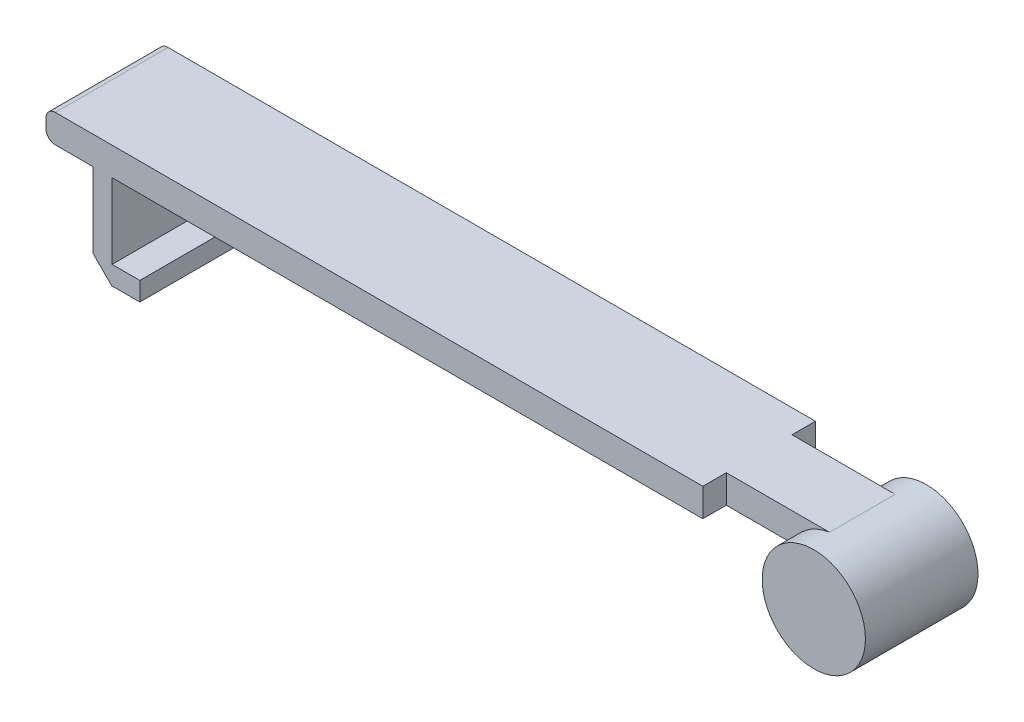
ISO-10303-21;
HEADER;
FILE_DESCRIPTION(('STEP AP214'),'2;1');
FILE_NAME('part.step','',(''),(''),'','','');
FILE_SCHEMA(('AUTOMOTIVE_DESIGN { 1 0 10303 214 1 1 1 1 }'));
ENDSEC;
DATA;
#1=APPLICATION_CONTEXT('core data for automotive mechanical design processes');
#2=APPLICATION_PROTOCOL_DEFINITION('international standard','automotive_design',2000,#1);
#3=PRODUCT_CONTEXT('',#1,'mechanical');
#4=PRODUCT('Part','Part','',(#3));
#5=PRODUCT_RELATED_PRODUCT_CATEGORY('part','',(#4));
#6=PRODUCT_DEFINITION_FORMATION('','',#4);
#7=PRODUCT_DEFINITION_CONTEXT('part definition',#1,'design');
#8=PRODUCT_DEFINITION('design','',#6,#7);
#9=PRODUCT_DEFINITION_SHAPE('','',#8);
#10=(LENGTH_UNIT() NAMED_UNIT(*) SI_UNIT(.MILLI.,.METRE.));
#11=(NAMED_UNIT(*) PLANE_ANGLE_UNIT() SI_UNIT($,.RADIAN.));
#12=(NAMED_UNIT(*) SI_UNIT($,.STERADIAN.) SOLID_ANGLE_UNIT());
#13=UNCERTAINTY_MEASURE_WITH_UNIT(LENGTH_MEASURE(1.E-05),#10,'distance_accuracy_value','');
#14=(GEOMETRIC_REPRESENTATION_CONTEXT(3) GLOBAL_UNCERTAINTY_ASSIGNED_CONTEXT((#13)) GLOBAL_UNIT_ASSIGNED_CONTEXT((#10,
#11,#12)) REPRESENTATION_CONTEXT('',''));
#15=CARTESIAN_POINT('',(0.,0.,0.));
#16=DIRECTION('',(0.,0.,1.));
#17=DIRECTION('',(1.,0.,0.));
#18=AXIS2_PLACEMENT_3D('',#15,#16,#17);
#19=CARTESIAN_POINT('',(25.4772203721698,0.406206053459805,12.));
#20=DIRECTION('',(0.,0.,-1.));
#21=DIRECTION('',(-1.,0.,0.));
#22=AXIS2_PLACEMENT_3D('',#19,#20,#21);
#23=CYLINDRICAL_SURFACE('',#22,5.5);
#24=CARTESIAN_POINT('',(25.4772203721698,0.406206053459805,0.));
#25=DIRECTION('',(0.,0.,1.));
#26=DIRECTION('',(1.,0.,0.));
#27=AXIS2_PLACEMENT_3D('',#24,#25,#26);
#28=CIRCLE('',#27,5.5);
#29=CARTESIAN_POINT('',(30.9772203721698,0.406206053459805,0.));
#30=VERTEX_POINT('',#29);
#31=EDGE_CURVE('E280',#30,#30,#28,.T.);
#32=ORIENTED_EDGE('',*,*,#31,.T.);
#33=EDGE_LOOP('',(#32));
#34=FACE_BOUND('',#33,.T.);
#35=CARTESIAN_POINT('',(25.4772203721698,0.406206053459805,12.));
#36=DIRECTION('',(0.,0.,1.));
#37=DIRECTION('',(1.,0.,0.));
#38=AXIS2_PLACEMENT_3D('',#35,#36,#37);
#39=CIRCLE('',#38,5.5);
#40=CARTESIAN_POINT('',(30.9772203721698,0.406206053459805,12.));
#41=VERTEX_POINT('',#40);
#42=EDGE_CURVE('E292',#41,#41,#39,.T.);
#43=ORIENTED_EDGE('',*,*,#42,.F.);
#44=EDGE_LOOP('',(#43));
#45=FACE_BOUND('',#44,.T.);
#46=CARTESIAN_POINT('',(25.4772203721698,0.406206053459805,9.5));
#47=DIRECTION('',(0.,0.,-1.));
#48=DIRECTION('',(-1.,0.,0.));
#49=AXIS2_PLACEMENT_3D('',#46,#47,#48);
#50=CIRCLE('',#49,5.5);
#51=CARTESIAN_POINT('',(20.5468422356375,2.84369891105021,9.5));
#52=VERTEX_POINT('',#51);
#53=CARTESIAN_POINT('',(24.6503761161861,5.84369891105021,9.5));
#54=VERTEX_POINT('',#53);
#55=EDGE_CURVE('E285',#52,#54,#50,.T.);
#56=ORIENTED_EDGE('',*,*,#55,.F.);
#57=DIRECTION('',(0.,0.,-1.));
#58=VECTOR('',#57,1.);
#59=CARTESIAN_POINT('',(20.5468422356375,2.84369891105021,12.));
#60=LINE('',#59,#58);
#61=CARTESIAN_POINT('',(20.5468422356375,2.84369891105021,2.5));
#62=VERTEX_POINT('',#61);
#63=EDGE_CURVE('E347',#62,#52,#60,.F.);
#64=ORIENTED_EDGE('',*,*,#63,.F.);
#65=CARTESIAN_POINT('',(25.4772203721698,0.406206053459805,2.5));
#66=DIRECTION('',(0.,0.,-1.));
#67=DIRECTION('',(-1.,0.,0.));
#68=AXIS2_PLACEMENT_3D('',#65,#66,#67);
#69=CIRCLE('',#68,5.5);
#70=CARTESIAN_POINT('',(24.6503761161861,5.84369891105021,2.5));
#71=VERTEX_POINT('',#70);
#72=EDGE_CURVE('E345',#62,#71,#69,.T.);
#73=ORIENTED_EDGE('',*,*,#72,.T.);
#74=DIRECTION('',(0.,0.,-1.));
#75=VECTOR('',#74,1.);
#76=CARTESIAN_POINT('',(24.6503761161861,5.84369891105021,12.));
#77=LINE('',#76,#75);
#78=EDGE_CURVE('E341',#54,#71,#77,.T.);
#79=ORIENTED_EDGE('',*,*,#78,.F.);
#80=EDGE_LOOP('',(#56,#64,#73,#79));
#81=FACE_BOUND('',#80,.T.);
#82=ADVANCED_FACE('F59',(#34,#45,#81),#23,.T.);
#83=CARTESIAN_POINT('',(25.4772203721698,0.406206053459805,12.));
#84=DIRECTION('',(0.,0.,1.));
#85=DIRECTION('',(1.,0.,0.));
#86=AXIS2_PLACEMENT_3D('',#83,#84,#85);
#87=PLANE('',#86);
#88=ORIENTED_EDGE('',*,*,#42,.T.);
#89=EDGE_LOOP('',(#88));
#90=FACE_BOUND('',#89,.T.);
#91=ADVANCED_FACE('F358',(#90),#87,.T.);
#92=CARTESIAN_POINT('',(25.4772203721698,0.406206053459805,0.));
#93=DIRECTION('',(0.,0.,1.));
#94=DIRECTION('',(1.,0.,0.));
#95=AXIS2_PLACEMENT_3D('',#92,#93,#94);
#96=PLANE('',#95);
#97=ORIENTED_EDGE('',*,*,#31,.F.);
#98=EDGE_LOOP('',(#97));
#99=FACE_BOUND('',#98,.T.);
#100=ADVANCED_FACE('F365',(#99),#96,.F.);
#101=CARTESIAN_POINT('',(25.6544305883111,5.84369891105021,9.5));
#102=DIRECTION('',(0.,-1.,0.));
#103=DIRECTION('',(1.,0.,0.));
#104=AXIS2_PLACEMENT_3D('',#101,#102,#103);
#105=PLANE('',#104);
#106=DIRECTION('',(-1.,0.,0.));
#107=VECTOR('',#106,1.);
#108=CARTESIAN_POINT('',(0.,5.84369891105021,0.));
#109=LINE('',#108,#107);
#110=CARTESIAN_POINT('',(13.6544305883111,5.84369891105021,0.));
#111=VERTEX_POINT('',#110);
#112=CARTESIAN_POINT('',(-55.3455694116889,5.8436989110502,0.));
#113=VERTEX_POINT('',#112);
#114=EDGE_CURVE('E217',#111,#113,#109,.T.);
#115=ORIENTED_EDGE('',*,*,#114,.T.);
#116=DIRECTION('',(0.,0.,-1.));
#117=VECTOR('',#116,1.);
#118=CARTESIAN_POINT('',(-55.3455694116889,5.84369891105021,9.5));
#119=LINE('',#118,#117);
#120=CARTESIAN_POINT('',(-55.3455694116889,5.8436989110502,12.));
#121=VERTEX_POINT('',#120);
#122=EDGE_CURVE('E12',#113,#121,#119,.F.);
#123=ORIENTED_EDGE('',*,*,#122,.T.);
#124=DIRECTION('',(-1.,0.,0.));
#125=VECTOR('',#124,1.);
#126=CARTESIAN_POINT('',(0.,5.84369891105021,12.));
#127=LINE('',#126,#125);
#128=CARTESIAN_POINT('',(13.6544305883111,5.84369891105021,12.));
#129=VERTEX_POINT('',#128);
#130=EDGE_CURVE('E219',#129,#121,#127,.T.);
#131=ORIENTED_EDGE('',*,*,#130,.F.);
#132=DIRECTION('',(0.,0.,-1.));
#133=VECTOR('',#132,1.);
#134=CARTESIAN_POINT('',(13.6544305883111,5.84369891105021,12.));
#135=LINE('',#134,#133);
#136=CARTESIAN_POINT('',(13.6544305883111,5.84369891105021,9.5));
#137=VERTEX_POINT('',#136);
#138=EDGE_CURVE('E249',#129,#137,#135,.T.);
#139=ORIENTED_EDGE('',*,*,#138,.T.);
#140=DIRECTION('',(-1.,0.,0.));
#141=VECTOR('',#140,1.);
#142=CARTESIAN_POINT('',(25.6544305883111,5.84369891105021,9.5));
#143=LINE('',#142,#141);
#144=EDGE_CURVE('E278',#54,#137,#143,.T.);
#145=ORIENTED_EDGE('',*,*,#144,.F.);
#146=ORIENTED_EDGE('',*,*,#78,.T.);
#147=DIRECTION('',(-1.,0.,0.));
#148=VECTOR('',#147,1.);
#149=CARTESIAN_POINT('',(25.6544305883111,5.84369891105021,2.5));
#150=LINE('',#149,#148);
#151=CARTESIAN_POINT('',(13.6544305883111,5.84369891105021,2.5));
#152=VERTEX_POINT('',#151);
#153=EDGE_CURVE('E205',#71,#152,#150,.T.);
#154=ORIENTED_EDGE('',*,*,#153,.T.);
#155=EDGE_CURVE('E233',#152,#111,#135,.T.);
#156=ORIENTED_EDGE('',*,*,#155,.T.);
#157=EDGE_LOOP('',(#115,#123,#131,#139,#145,#146,#154,#156));
#158=FACE_BOUND('',#157,.T.);
#159=ADVANCED_FACE('F338',(#158),#105,.F.);
#160=CARTESIAN_POINT('',(25.6544305883111,2.84369891105021,9.5));
#161=DIRECTION('',(0.,1.,0.));
#162=DIRECTION('',(-1.,0.,0.));
#163=AXIS2_PLACEMENT_3D('',#160,#161,#162);
#164=PLANE('',#163);
#165=DIRECTION('',(1.,0.,0.));
#166=VECTOR('',#165,1.);
#167=CARTESIAN_POINT('',(25.6544305883111,2.84369891105021,2.5));
#168=LINE('',#167,#166);
#169=CARTESIAN_POINT('',(13.6544305883111,2.84369891105021,2.5));
#170=VERTEX_POINT('',#169);
#171=EDGE_CURVE('E282',#170,#62,#168,.T.);
#172=ORIENTED_EDGE('',*,*,#171,.T.);
#173=ORIENTED_EDGE('',*,*,#63,.T.);
#174=DIRECTION('',(1.,0.,0.));
#175=VECTOR('',#174,1.);
#176=CARTESIAN_POINT('',(25.6544305883111,2.84369891105021,9.5));
#177=LINE('',#176,#175);
#178=CARTESIAN_POINT('',(13.6544305883111,2.84369891105021,9.5));
#179=VERTEX_POINT('',#178);
#180=EDGE_CURVE('E277',#179,#52,#177,.T.);
#181=ORIENTED_EDGE('',*,*,#180,.F.);
#182=DIRECTION('',(0.,0.,-1.));
#183=VECTOR('',#182,1.);
#184=CARTESIAN_POINT('',(13.6544305883111,2.84369891105021,12.));
#185=LINE('',#184,#183);
#186=CARTESIAN_POINT('',(13.6544305883111,2.84369891105021,12.));
#187=VERTEX_POINT('',#186);
#188=EDGE_CURVE('E224',#187,#179,#185,.T.);
#189=ORIENTED_EDGE('',*,*,#188,.F.);
#190=DIRECTION('',(-1.,0.,0.));
#191=VECTOR('',#190,1.);
#192=CARTESIAN_POINT('',(13.6544305883111,2.84369891105021,12.));
#193=LINE('',#192,#191);
#194=CARTESIAN_POINT('',(-49.2981564777046,2.8436989110502,12.));
#195=VERTEX_POINT('',#194);
#196=EDGE_CURVE('E230',#187,#195,#193,.T.);
#197=ORIENTED_EDGE('',*,*,#196,.T.);
#198=DIRECTION('',(0.,0.,-1.));
#199=VECTOR('',#198,1.);
#200=CARTESIAN_POINT('',(-49.2981564777046,2.8436989110502,12.));
#201=LINE('',#200,#199);
#202=CARTESIAN_POINT('',(-49.2981564777046,2.8436989110502,0.));
#203=VERTEX_POINT('',#202);
#204=EDGE_CURVE('E186',#195,#203,#201,.T.);
#205=ORIENTED_EDGE('',*,*,#204,.T.);
#206=DIRECTION('',(-1.,0.,0.));
#207=VECTOR('',#206,1.);
#208=CARTESIAN_POINT('',(13.6544305883111,2.84369891105021,0.));
#209=LINE('',#208,#207);
#210=CARTESIAN_POINT('',(13.6544305883111,2.84369891105021,0.));
#211=VERTEX_POINT('',#210);
#212=EDGE_CURVE('E231',#211,#203,#209,.T.);
#213=ORIENTED_EDGE('',*,*,#212,.F.);
#214=EDGE_CURVE('E245',#170,#211,#185,.T.);
#215=ORIENTED_EDGE('',*,*,#214,.F.);
#216=EDGE_LOOP('',(#172,#173,#181,#189,#197,#205,#213,#215));
#217=FACE_BOUND('',#216,.T.);
#218=ADVANCED_FACE('F267',(#217),#164,.F.);
#219=CARTESIAN_POINT('',(0.,0.,9.5));
#220=DIRECTION('',(0.,0.,-1.));
#221=DIRECTION('',(-1.,0.,0.));
#222=AXIS2_PLACEMENT_3D('',#219,#220,#221);
#223=PLANE('',#222);
#224=ORIENTED_EDGE('',*,*,#180,.T.);
#225=ORIENTED_EDGE('',*,*,#55,.T.);
#226=ORIENTED_EDGE('',*,*,#144,.T.);
#227=DIRECTION('',(0.,-1.,0.));
#228=VECTOR('',#227,1.);
#229=CARTESIAN_POINT('',(13.6544305883111,5.84369891105021,9.5));
#230=LINE('',#229,#228);
#231=EDGE_CURVE('E274',#137,#179,#230,.T.);
#232=ORIENTED_EDGE('',*,*,#231,.T.);
#233=EDGE_LOOP('',(#224,#225,#226,#232));
#234=FACE_BOUND('',#233,.T.);
#235=ADVANCED_FACE('F506',(#234),#223,.F.);
#236=CARTESIAN_POINT('',(0.,0.,2.5));
#237=DIRECTION('',(0.,0.,-1.));
#238=DIRECTION('',(-1.,0.,0.));
#239=AXIS2_PLACEMENT_3D('',#236,#237,#238);
#240=PLANE('',#239);
#241=ORIENTED_EDGE('',*,*,#72,.F.);
#242=ORIENTED_EDGE('',*,*,#171,.F.);
#243=DIRECTION('',(0.,-1.,0.));
#244=VECTOR('',#243,1.);
#245=CARTESIAN_POINT('',(13.6544305883111,5.84369891105021,2.5));
#246=LINE('',#245,#244);
#247=EDGE_CURVE('E208',#152,#170,#246,.T.);
#248=ORIENTED_EDGE('',*,*,#247,.F.);
#249=ORIENTED_EDGE('',*,*,#153,.F.);
#250=EDGE_LOOP('',(#241,#242,#248,#249));
#251=FACE_BOUND('',#250,.T.);
#252=ADVANCED_FACE('F344',(#251),#240,.T.);
#253=CARTESIAN_POINT('',(13.6544305883111,2.84369891105021,12.));
#254=DIRECTION('',(-1.,0.,0.));
#255=DIRECTION('',(0.,0.,1.));
#256=AXIS2_PLACEMENT_3D('',#253,#254,#255);
#257=PLANE('',#256);
#258=ORIENTED_EDGE('',*,*,#155,.F.);
#259=ORIENTED_EDGE('',*,*,#247,.T.);
#260=ORIENTED_EDGE('',*,*,#214,.T.);
#261=DIRECTION('',(0.,1.,0.));
#262=VECTOR('',#261,1.);
#263=CARTESIAN_POINT('',(13.6544305883111,2.84369891105021,0.));
#264=LINE('',#263,#262);
#265=EDGE_CURVE('E234',#211,#111,#264,.T.);
#266=ORIENTED_EDGE('',*,*,#265,.T.);
#267=EDGE_LOOP('',(#258,#259,#260,#266));
#268=FACE_BOUND('',#267,.T.);
#269=ADVANCED_FACE('F257',(#268),#257,.F.);
#270=CARTESIAN_POINT('',(0.,-5.1563010889498,12.));
#271=DIRECTION('',(0.,-1.,0.));
#272=DIRECTION('',(0.,0.,-1.));
#273=AXIS2_PLACEMENT_3D('',#270,#271,#272);
#274=PLANE('',#273);
#275=DIRECTION('',(-1.,0.,0.));
#276=VECTOR('',#275,1.);
#277=CARTESIAN_POINT('',(0.,-5.1563010889498,0.));
#278=LINE('',#277,#276);
#279=CARTESIAN_POINT('',(-46.3455694116889,-5.1563010889498,0.));
#280=VERTEX_POINT('',#279);
#281=CARTESIAN_POINT('',(-49.2981564777046,-5.1563010889498,0.));
#282=VERTEX_POINT('',#281);
#283=EDGE_CURVE('E204',#280,#282,#278,.T.);
#284=ORIENTED_EDGE('',*,*,#283,.T.);
#285=DIRECTION('',(0.,0.,-1.));
#286=VECTOR('',#285,1.);
#287=CARTESIAN_POINT('',(-49.2981564777046,-5.1563010889498,12.));
#288=LINE('',#287,#286);
#289=CARTESIAN_POINT('',(-49.2981564777046,-5.1563010889498,12.));
#290=VERTEX_POINT('',#289);
#291=EDGE_CURVE('E184',#290,#282,#288,.T.);
#292=ORIENTED_EDGE('',*,*,#291,.F.);
#293=DIRECTION('',(-1.,0.,0.));
#294=VECTOR('',#293,1.);
#295=CARTESIAN_POINT('',(0.,-5.1563010889498,12.));
#296=LINE('',#295,#294);
#297=CARTESIAN_POINT('',(-46.3455694116889,-5.1563010889498,12.));
#298=VERTEX_POINT('',#297);
#299=EDGE_CURVE('E191',#298,#290,#296,.T.);
#300=ORIENTED_EDGE('',*,*,#299,.F.);
#301=DIRECTION('',(0.,0.,-1.));
#302=VECTOR('',#301,1.);
#303=CARTESIAN_POINT('',(-46.3455694116889,-5.1563010889498,12.));
#304=LINE('',#303,#302);
#305=EDGE_CURVE('E555',#298,#280,#304,.T.);
#306=ORIENTED_EDGE('',*,*,#305,.T.);
#307=EDGE_LOOP('',(#284,#292,#300,#306));
#308=FACE_BOUND('',#307,.T.);
#309=ADVANCED_FACE('F202',(#308),#274,.F.);
#310=CARTESIAN_POINT('',(-49.2981564777046,0.,12.));
#311=DIRECTION('',(-1.,0.,0.));
#312=DIRECTION('',(0.,0.,1.));
#313=AXIS2_PLACEMENT_3D('',#310,#311,#312);
#314=PLANE('',#313);
#315=DIRECTION('',(0.,1.,0.));
#316=VECTOR('',#315,1.);
#317=CARTESIAN_POINT('',(-49.2981564777046,0.,0.));
#318=LINE('',#317,#316);
#319=EDGE_CURVE('E562',#282,#203,#318,.T.);
#320=ORIENTED_EDGE('',*,*,#319,.T.);
#321=ORIENTED_EDGE('',*,*,#204,.F.);
#322=DIRECTION('',(0.,1.,0.));
#323=VECTOR('',#322,1.);
#324=CARTESIAN_POINT('',(-49.2981564777046,0.,12.));
#325=LINE('',#324,#323);
#326=EDGE_CURVE('E179',#290,#195,#325,.T.);
#327=ORIENTED_EDGE('',*,*,#326,.F.);
#328=ORIENTED_EDGE('',*,*,#291,.T.);
#329=EDGE_LOOP('',(#320,#321,#327,#328));
#330=FACE_BOUND('',#329,.T.);
#331=ADVANCED_FACE('F182',(#330),#314,.F.);
#332=CARTESIAN_POINT('',(-51.3455694116889,0.,12.));
#333=DIRECTION('',(1.,0.,0.));
#334=DIRECTION('',(0.,0.,-1.));
#335=AXIS2_PLACEMENT_3D('',#332,#333,#334);
#336=PLANE('',#335);
#337=DIRECTION('',(0.,-1.,0.));
#338=VECTOR('',#337,1.);
#339=CARTESIAN_POINT('',(-51.3455694116889,0.,0.));
#340=LINE('',#339,#338);
#341=CARTESIAN_POINT('',(-51.3455694116889,2.8436989110502,0.));
#342=VERTEX_POINT('',#341);
#343=CARTESIAN_POINT('',(-51.3455694116889,-5.15630108894978,0.));
#344=VERTEX_POINT('',#343);
#345=EDGE_CURVE('E564',#342,#344,#340,.T.);
#346=ORIENTED_EDGE('',*,*,#345,.T.);
#347=DIRECTION('',(0.,0.,1.));
#348=VECTOR('',#347,1.);
#349=CARTESIAN_POINT('',(-51.3455694116889,-5.15630108894978,12.));
#350=LINE('',#349,#348);
#351=CARTESIAN_POINT('',(-51.3455694116889,-5.15630108894977,12.));
#352=VERTEX_POINT('',#351);
#353=EDGE_CURVE('E306',#344,#352,#350,.T.);
#354=ORIENTED_EDGE('',*,*,#353,.T.);
#355=DIRECTION('',(0.,-1.,0.));
#356=VECTOR('',#355,1.);
#357=CARTESIAN_POINT('',(-51.3455694116889,0.,12.));
#358=LINE('',#357,#356);
#359=CARTESIAN_POINT('',(-51.3455694116889,2.8436989110502,12.));
#360=VERTEX_POINT('',#359);
#361=EDGE_CURVE('E190',#360,#352,#358,.T.);
#362=ORIENTED_EDGE('',*,*,#361,.F.);
#363=DIRECTION('',(0.,0.,-1.));
#364=VECTOR('',#363,1.);
#365=CARTESIAN_POINT('',(-51.3455694116889,2.8436989110502,12.));
#366=LINE('',#365,#364);
#367=EDGE_CURVE('E210',#360,#342,#366,.T.);
#368=ORIENTED_EDGE('',*,*,#367,.T.);
#369=EDGE_LOOP('',(#346,#354,#362,#368));
#370=FACE_BOUND('',#369,.T.);
#371=ADVANCED_FACE('F449',(#370),#336,.F.);
#372=CARTESIAN_POINT('',(0.,-7.1563010889498,12.));
#373=DIRECTION('',(0.,1.,0.));
#374=DIRECTION('',(0.,0.,1.));
#375=AXIS2_PLACEMENT_3D('',#372,#373,#374);
#376=PLANE('',#375);
#377=DIRECTION('',(1.,0.,0.));
#378=VECTOR('',#377,1.);
#379=CARTESIAN_POINT('',(0.,-7.1563010889498,12.));
#380=LINE('',#379,#378);
#381=CARTESIAN_POINT('',(-49.3455694116889,-7.1563010889498,12.));
#382=VERTEX_POINT('',#381);
#383=CARTESIAN_POINT('',(-46.3455694116889,-7.1563010889498,12.));
#384=VERTEX_POINT('',#383);
#385=EDGE_CURVE('E576',#382,#384,#380,.T.);
#386=ORIENTED_EDGE('',*,*,#385,.F.);
#387=DIRECTION('',(0.,0.,-1.));
#388=VECTOR('',#387,1.);
#389=CARTESIAN_POINT('',(-49.3455694116889,-7.1563010889498,12.));
#390=LINE('',#389,#388);
#391=CARTESIAN_POINT('',(-49.3455694116889,-7.1563010889498,0.));
#392=VERTEX_POINT('',#391);
#393=EDGE_CURVE('E301',#382,#392,#390,.T.);
#394=ORIENTED_EDGE('',*,*,#393,.T.);
#395=DIRECTION('',(1.,0.,0.));
#396=VECTOR('',#395,1.);
#397=CARTESIAN_POINT('',(0.,-7.1563010889498,0.));
#398=LINE('',#397,#396);
#399=CARTESIAN_POINT('',(-46.3455694116889,-7.1563010889498,0.));
#400=VERTEX_POINT('',#399);
#401=EDGE_CURVE('E559',#392,#400,#398,.T.);
#402=ORIENTED_EDGE('',*,*,#401,.T.);
#403=DIRECTION('',(0.,0.,-1.));
#404=VECTOR('',#403,1.);
#405=CARTESIAN_POINT('',(-46.3455694116889,-7.1563010889498,12.));
#406=LINE('',#405,#404);
#407=EDGE_CURVE('E557',#384,#400,#406,.T.);
#408=ORIENTED_EDGE('',*,*,#407,.F.);
#409=EDGE_LOOP('',(#386,#394,#402,#408));
#410=FACE_BOUND('',#409,.T.);
#411=ADVANCED_FACE('F444',(#410),#376,.F.);
#412=CARTESIAN_POINT('',(-46.3455694116889,0.,12.));
#413=DIRECTION('',(-1.,0.,0.));
#414=DIRECTION('',(0.,0.,1.));
#415=AXIS2_PLACEMENT_3D('',#412,#413,#414);
#416=PLANE('',#415);
#417=DIRECTION('',(0.,1.,0.));
#418=VECTOR('',#417,1.);
#419=CARTESIAN_POINT('',(-46.3455694116889,0.,0.));
#420=LINE('',#419,#418);
#421=EDGE_CURVE('E200',#400,#280,#420,.T.);
#422=ORIENTED_EDGE('',*,*,#421,.T.);
#423=ORIENTED_EDGE('',*,*,#305,.F.);
#424=DIRECTION('',(0.,1.,0.));
#425=VECTOR('',#424,1.);
#426=CARTESIAN_POINT('',(-46.3455694116889,0.,12.));
#427=LINE('',#426,#425);
#428=EDGE_CURVE('E196',#384,#298,#427,.T.);
#429=ORIENTED_EDGE('',*,*,#428,.F.);
#430=ORIENTED_EDGE('',*,*,#407,.T.);
#431=EDGE_LOOP('',(#422,#423,#429,#430));
#432=FACE_BOUND('',#431,.T.);
#433=ADVANCED_FACE('F419',(#432),#416,.F.);
#434=CARTESIAN_POINT('',(0.,0.,12.));
#435=DIRECTION('',(0.,0.,1.));
#436=DIRECTION('',(1.,0.,0.));
#437=AXIS2_PLACEMENT_3D('',#434,#435,#436);
#438=PLANE('',#437);
#439=DIRECTION('',(0.,-1.,0.));
#440=VECTOR('',#439,1.);
#441=CARTESIAN_POINT('',(-56.3455694116889,0.,12.));
#442=LINE('',#441,#440);
#443=CARTESIAN_POINT('',(-56.3455694116889,4.84369891105021,12.));
#444=VERTEX_POINT('',#443);
#445=CARTESIAN_POINT('',(-56.3455694116889,3.8436989110502,12.));
#446=VERTEX_POINT('',#445);
#447=EDGE_CURVE('E214',#444,#446,#442,.T.);
#448=ORIENTED_EDGE('',*,*,#447,.T.);
#449=CARTESIAN_POINT('',(-55.3455694116889,3.8436989110502,12.));
#450=DIRECTION('',(0.,0.,1.));
#451=DIRECTION('',(1.,0.,0.));
#452=AXIS2_PLACEMENT_3D('',#449,#450,#451);
#453=CIRCLE('',#452,1.);
#454=CARTESIAN_POINT('',(-55.3455694116889,2.8436989110502,12.));
#455=VERTEX_POINT('',#454);
#456=EDGE_CURVE('E67',#446,#455,#453,.T.);
#457=ORIENTED_EDGE('',*,*,#456,.T.);
#458=DIRECTION('',(1.,0.,0.));
#459=VECTOR('',#458,1.);
#460=CARTESIAN_POINT('',(0.,2.84369891105021,12.));
#461=LINE('',#460,#459);
#462=EDGE_CURVE('E216',#455,#360,#461,.T.);
#463=ORIENTED_EDGE('',*,*,#462,.T.);
#464=ORIENTED_EDGE('',*,*,#361,.T.);
#465=DIRECTION('',(-0.707106781186548,0.707106781186548,0.));
#466=VECTOR('',#465,1.);
#467=CARTESIAN_POINT('',(-28.2509352503194,-28.2509352503194,12.));
#468=LINE('',#467,#466);
#469=EDGE_CURVE('E308',#352,#382,#468,.F.);
#470=ORIENTED_EDGE('',*,*,#469,.T.);
#471=ORIENTED_EDGE('',*,*,#385,.T.);
#472=ORIENTED_EDGE('',*,*,#428,.T.);
#473=ORIENTED_EDGE('',*,*,#299,.T.);
#474=ORIENTED_EDGE('',*,*,#326,.T.);
#475=ORIENTED_EDGE('',*,*,#196,.F.);
#476=DIRECTION('',(0.,1.,0.));
#477=VECTOR('',#476,1.);
#478=CARTESIAN_POINT('',(13.6544305883111,2.84369891105021,12.));
#479=LINE('',#478,#477);
#480=EDGE_CURVE('E227',#187,#129,#479,.T.);
#481=ORIENTED_EDGE('',*,*,#480,.T.);
#482=ORIENTED_EDGE('',*,*,#130,.T.);
#483=CARTESIAN_POINT('',(-55.3455694116889,4.84369891105021,12.));
#484=DIRECTION('',(0.,0.,1.));
#485=DIRECTION('',(1.,0.,0.));
#486=AXIS2_PLACEMENT_3D('',#483,#484,#485);
#487=CIRCLE('',#486,1.);
#488=EDGE_CURVE('E321',#121,#444,#487,.T.);
#489=ORIENTED_EDGE('',*,*,#488,.T.);
#490=EDGE_LOOP('',(#448,#457,#463,#464,#470,#471,#472,#473,#474,#475,#481,#482,#489));
#491=FACE_BOUND('',#490,.T.);
#492=ADVANCED_FACE('F194',(#491),#438,.T.);
#493=CARTESIAN_POINT('',(0.,0.,0.));
#494=DIRECTION('',(0.,0.,1.));
#495=DIRECTION('',(1.,0.,0.));
#496=AXIS2_PLACEMENT_3D('',#493,#494,#495);
#497=PLANE('',#496);
#498=DIRECTION('',(1.,0.,0.));
#499=VECTOR('',#498,1.);
#500=CARTESIAN_POINT('',(0.,2.84369891105021,0.));
#501=LINE('',#500,#499);
#502=CARTESIAN_POINT('',(-55.3455694116889,2.8436989110502,0.));
#503=VERTEX_POINT('',#502);
#504=EDGE_CURVE('E223',#503,#342,#501,.T.);
#505=ORIENTED_EDGE('',*,*,#504,.F.);
#506=CARTESIAN_POINT('',(-55.3455694116889,3.8436989110502,0.));
#507=DIRECTION('',(0.,0.,1.));
#508=DIRECTION('',(1.,0.,0.));
#509=AXIS2_PLACEMENT_3D('',#506,#507,#508);
#510=CIRCLE('',#509,1.);
#511=CARTESIAN_POINT('',(-56.3455694116889,3.8436989110502,0.));
#512=VERTEX_POINT('',#511);
#513=EDGE_CURVE('E315',#503,#512,#510,.F.);
#514=ORIENTED_EDGE('',*,*,#513,.T.);
#515=DIRECTION('',(0.,-1.,0.));
#516=VECTOR('',#515,1.);
#517=CARTESIAN_POINT('',(-56.3455694116889,0.,0.));
#518=LINE('',#517,#516);
#519=CARTESIAN_POINT('',(-56.3455694116889,4.84369891105021,0.));
#520=VERTEX_POINT('',#519);
#521=EDGE_CURVE('E221',#520,#512,#518,.T.);
#522=ORIENTED_EDGE('',*,*,#521,.F.);
#523=CARTESIAN_POINT('',(-55.3455694116889,4.84369891105021,0.));
#524=DIRECTION('',(0.,0.,1.));
#525=DIRECTION('',(1.,0.,0.));
#526=AXIS2_PLACEMENT_3D('',#523,#524,#525);
#527=CIRCLE('',#526,1.);
#528=EDGE_CURVE('E313',#520,#113,#527,.F.);
#529=ORIENTED_EDGE('',*,*,#528,.T.);
#530=ORIENTED_EDGE('',*,*,#114,.F.);
#531=ORIENTED_EDGE('',*,*,#265,.F.);
#532=ORIENTED_EDGE('',*,*,#212,.T.);
#533=ORIENTED_EDGE('',*,*,#319,.F.);
#534=ORIENTED_EDGE('',*,*,#283,.F.);
#535=ORIENTED_EDGE('',*,*,#421,.F.);
#536=ORIENTED_EDGE('',*,*,#401,.F.);
#537=DIRECTION('',(0.707106781186548,-0.707106781186548,0.));
#538=VECTOR('',#537,1.);
#539=CARTESIAN_POINT('',(-49.3455694116889,-7.1563010889498,0.));
#540=LINE('',#539,#538);
#541=EDGE_CURVE('E304',#392,#344,#540,.F.);
#542=ORIENTED_EDGE('',*,*,#541,.T.);
#543=ORIENTED_EDGE('',*,*,#345,.F.);
#544=EDGE_LOOP('',(#505,#514,#522,#529,#530,#531,#532,#533,#534,#535,#536,#542,#543));
#545=FACE_BOUND('',#544,.T.);
#546=ADVANCED_FACE('F266',(#545),#497,.F.);
#547=CARTESIAN_POINT('',(-56.3455694116889,0.,12.));
#548=DIRECTION('',(1.,0.,0.));
#549=DIRECTION('',(0.,0.,-1.));
#550=AXIS2_PLACEMENT_3D('',#547,#548,#549);
#551=PLANE('',#550);
#552=ORIENTED_EDGE('',*,*,#521,.T.);
#553=DIRECTION('',(0.,0.,-1.));
#554=VECTOR('',#553,1.);
#555=CARTESIAN_POINT('',(-56.3455694116889,3.8436989110502,12.));
#556=LINE('',#555,#554);
#557=EDGE_CURVE('E80',#512,#446,#556,.F.);
#558=ORIENTED_EDGE('',*,*,#557,.T.);
#559=ORIENTED_EDGE('',*,*,#447,.F.);
#560=DIRECTION('',(0.,0.,-1.));
#561=VECTOR('',#560,1.);
#562=CARTESIAN_POINT('',(-56.3455694116889,4.84369891105021,12.));
#563=LINE('',#562,#561);
#564=EDGE_CURVE('E317',#444,#520,#563,.T.);
#565=ORIENTED_EDGE('',*,*,#564,.T.);
#566=EDGE_LOOP('',(#552,#558,#559,#565));
#567=FACE_BOUND('',#566,.T.);
#568=ADVANCED_FACE('F335',(#567),#551,.F.);
#569=ORIENTED_EDGE('',*,*,#231,.F.);
#570=ORIENTED_EDGE('',*,*,#138,.F.);
#571=ORIENTED_EDGE('',*,*,#480,.F.);
#572=ORIENTED_EDGE('',*,*,#188,.T.);
#573=EDGE_LOOP('',(#569,#570,#571,#572));
#574=FACE_BOUND('',#573,.T.);
#575=ADVANCED_FACE('F272',(#574),#257,.F.);
#576=CARTESIAN_POINT('',(0.,2.84369891105021,12.));
#577=DIRECTION('',(0.,1.,0.));
#578=DIRECTION('',(-1.,0.,0.));
#579=AXIS2_PLACEMENT_3D('',#576,#577,#578);
#580=PLANE('',#579);
#581=ORIENTED_EDGE('',*,*,#462,.F.);
#582=DIRECTION('',(0.,0.,-1.));
#583=VECTOR('',#582,1.);
#584=CARTESIAN_POINT('',(-55.3455694116889,2.8436989110502,12.));
#585=LINE('',#584,#583);
#586=EDGE_CURVE('E310',#455,#503,#585,.T.);
#587=ORIENTED_EDGE('',*,*,#586,.T.);
#588=ORIENTED_EDGE('',*,*,#504,.T.);
#589=ORIENTED_EDGE('',*,*,#367,.F.);
#590=EDGE_LOOP('',(#581,#587,#588,#589));
#591=FACE_BOUND('',#590,.T.);
#592=ADVANCED_FACE('F329',(#591),#580,.F.);
#593=CARTESIAN_POINT('',(-49.3455694116889,-7.1563010889498,12.));
#594=DIRECTION('',(0.707106781186547,0.707106781186547,0.));
#595=DIRECTION('',(0.,0.,-1.));
#596=AXIS2_PLACEMENT_3D('',#593,#594,#595);
#597=PLANE('',#596);
#598=ORIENTED_EDGE('',*,*,#469,.F.);
#599=ORIENTED_EDGE('',*,*,#353,.F.);
#600=ORIENTED_EDGE('',*,*,#541,.F.);
#601=ORIENTED_EDGE('',*,*,#393,.F.);
#602=EDGE_LOOP('',(#598,#599,#600,#601));
#603=FACE_BOUND('',#602,.T.);
#604=ADVANCED_FACE('F369',(#603),#597,.F.);
#605=CARTESIAN_POINT('',(-55.3455694116889,3.8436989110502,12.));
#606=DIRECTION('',(0.,0.,-1.));
#607=DIRECTION('',(-1.,0.,0.));
#608=AXIS2_PLACEMENT_3D('',#605,#606,#607);
#609=CYLINDRICAL_SURFACE('',#608,1.);
#610=ORIENTED_EDGE('',*,*,#456,.F.);
#611=ORIENTED_EDGE('',*,*,#557,.F.);
#612=ORIENTED_EDGE('',*,*,#513,.F.);
#613=ORIENTED_EDGE('',*,*,#586,.F.);
#614=EDGE_LOOP('',(#610,#611,#612,#613));
#615=FACE_BOUND('',#614,.T.);
#616=ADVANCED_FACE('F332',(#615),#609,.T.);
#617=CARTESIAN_POINT('',(-55.3455694116889,4.84369891105021,12.));
#618=DIRECTION('',(0.,0.,-1.));
#619=DIRECTION('',(-1.,0.,0.));
#620=AXIS2_PLACEMENT_3D('',#617,#618,#619);
#621=CYLINDRICAL_SURFACE('',#620,1.);
#622=ORIENTED_EDGE('',*,*,#488,.F.);
#623=ORIENTED_EDGE('',*,*,#122,.F.);
#624=ORIENTED_EDGE('',*,*,#528,.F.);
#625=ORIENTED_EDGE('',*,*,#564,.F.);
#626=EDGE_LOOP('',(#622,#623,#624,#625));
#627=FACE_BOUND('',#626,.T.);
#628=ADVANCED_FACE('F61',(#627),#621,.T.);
#629=CLOSED_SHELL('',(#82,#91,#100,#159,#218,#235,#252,#269,#309,#331,#371,#411,#433,#492,#546,
#568,#575,#592,#604,#616,#628));
#630=MANIFOLD_SOLID_BREP('B2',#629);
#631=ADVANCED_BREP_SHAPE_REPRESENTATION('',(#18,#630),#14);
#632=SHAPE_DEFINITION_REPRESENTATION(#9,#631);
ENDSEC;
END-ISO-10303-21;
